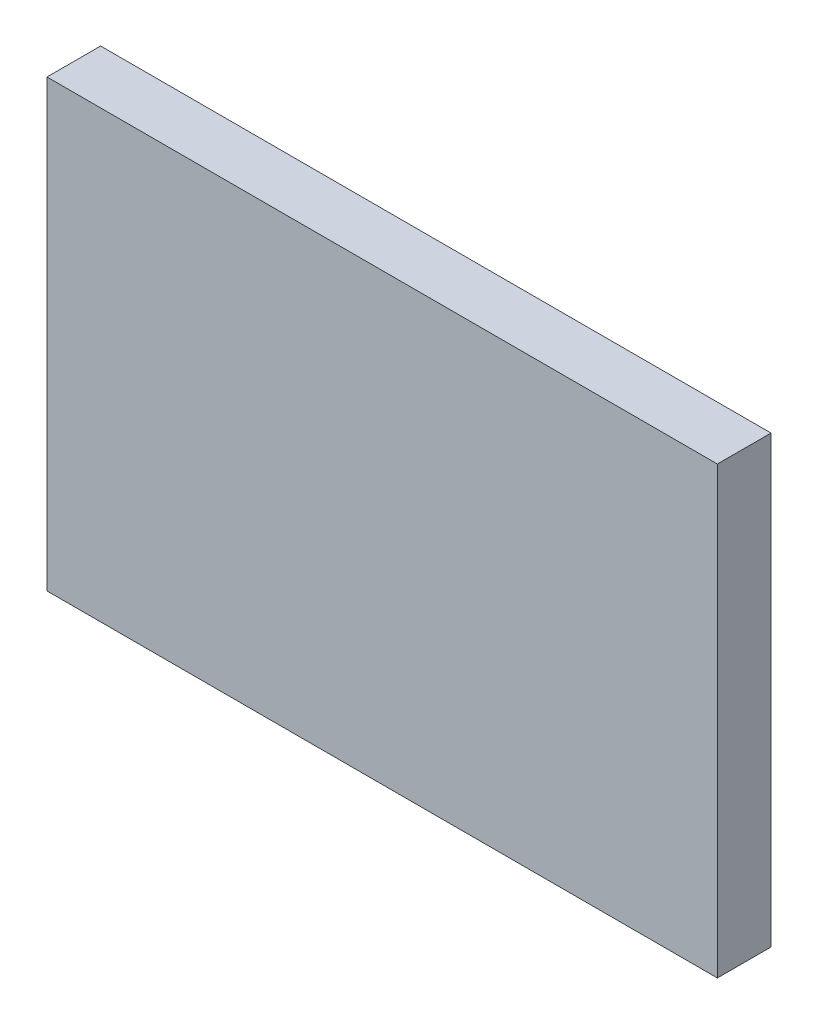
ISO-10303-21;
HEADER;
FILE_DESCRIPTION(('STEP AP214'),'2;1');
FILE_NAME('part.step','',(''),(''),'','','');
FILE_SCHEMA(('AUTOMOTIVE_DESIGN { 1 0 10303 214 1 1 1 1 }'));
ENDSEC;
DATA;
#1=APPLICATION_CONTEXT('core data for automotive mechanical design processes');
#2=APPLICATION_PROTOCOL_DEFINITION('international standard','automotive_design',2000,#1);
#3=PRODUCT_CONTEXT('',#1,'mechanical');
#4=PRODUCT('Part','Part','',(#3));
#5=PRODUCT_RELATED_PRODUCT_CATEGORY('part','',(#4));
#6=PRODUCT_DEFINITION_FORMATION('','',#4);
#7=PRODUCT_DEFINITION_CONTEXT('part definition',#1,'design');
#8=PRODUCT_DEFINITION('design','',#6,#7);
#9=PRODUCT_DEFINITION_SHAPE('','',#8);
#10=(LENGTH_UNIT() NAMED_UNIT(*) SI_UNIT(.MILLI.,.METRE.));
#11=(NAMED_UNIT(*) PLANE_ANGLE_UNIT() SI_UNIT($,.RADIAN.));
#12=(NAMED_UNIT(*) SI_UNIT($,.STERADIAN.) SOLID_ANGLE_UNIT());
#13=UNCERTAINTY_MEASURE_WITH_UNIT(LENGTH_MEASURE(1.E-05),#10,'distance_accuracy_value','');
#14=(GEOMETRIC_REPRESENTATION_CONTEXT(3) GLOBAL_UNCERTAINTY_ASSIGNED_CONTEXT((#13)) GLOBAL_UNIT_ASSIGNED_CONTEXT((#10,
#11,#12)) REPRESENTATION_CONTEXT('',''));
#15=CARTESIAN_POINT('',(0.,0.,0.));
#16=DIRECTION('',(0.,0.,1.));
#17=DIRECTION('',(1.,0.,0.));
#18=AXIS2_PLACEMENT_3D('',#15,#16,#17);
#19=CARTESIAN_POINT('',(0.,0.,0.05));
#20=DIRECTION('',(0.,0.,-1.));
#21=DIRECTION('',(0.,-1.,0.));
#22=AXIS2_PLACEMENT_3D('',#19,#20,#21);
#23=PLANE('',#22);
#24=DIRECTION('',(1.,0.,0.));
#25=VECTOR('',#24,1.);
#26=CARTESIAN_POINT('',(0.,0.,0.05));
#27=LINE('',#26,#25);
#28=CARTESIAN_POINT('',(0.,0.,0.05));
#29=VERTEX_POINT('',#28);
#30=CARTESIAN_POINT('',(0.625,0.,0.05));
#31=VERTEX_POINT('',#30);
#32=EDGE_CURVE('E82',#29,#31,#27,.T.);
#33=ORIENTED_EDGE('',*,*,#32,.T.);
#34=DIRECTION('',(0.,1.,0.));
#35=VECTOR('',#34,1.);
#36=CARTESIAN_POINT('',(0.625,0.,0.05));
#37=LINE('',#36,#35);
#38=CARTESIAN_POINT('',(0.625,0.415,0.05));
#39=VERTEX_POINT('',#38);
#40=EDGE_CURVE('E101',#31,#39,#37,.T.);
#41=ORIENTED_EDGE('',*,*,#40,.T.);
#42=DIRECTION('',(-1.,0.,0.));
#43=VECTOR('',#42,1.);
#44=CARTESIAN_POINT('',(0.625,0.415,0.05));
#45=LINE('',#44,#43);
#46=CARTESIAN_POINT('',(0.,0.415,0.05));
#47=VERTEX_POINT('',#46);
#48=EDGE_CURVE('E75',#39,#47,#45,.T.);
#49=ORIENTED_EDGE('',*,*,#48,.T.);
#50=DIRECTION('',(0.,-1.,0.));
#51=VECTOR('',#50,1.);
#52=CARTESIAN_POINT('',(0.,0.415,0.05));
#53=LINE('',#52,#51);
#54=EDGE_CURVE('E11',#47,#29,#53,.T.);
#55=ORIENTED_EDGE('',*,*,#54,.T.);
#56=EDGE_LOOP('',(#33,#41,#49,#55));
#57=FACE_BOUND('',#56,.T.);
#58=ADVANCED_FACE('F17',(#57),#23,.F.);
#59=CARTESIAN_POINT('',(0.,0.,0.));
#60=DIRECTION('',(0.,0.,-1.));
#61=DIRECTION('',(0.,-1.,0.));
#62=AXIS2_PLACEMENT_3D('',#59,#60,#61);
#63=PLANE('',#62);
#64=DIRECTION('',(0.,-1.,0.));
#65=VECTOR('',#64,1.);
#66=CARTESIAN_POINT('',(0.,0.415,0.));
#67=LINE('',#66,#65);
#68=CARTESIAN_POINT('',(0.,0.415,0.));
#69=VERTEX_POINT('',#68);
#70=CARTESIAN_POINT('',(0.,0.,0.));
#71=VERTEX_POINT('',#70);
#72=EDGE_CURVE('E20',#69,#71,#67,.T.);
#73=ORIENTED_EDGE('',*,*,#72,.F.);
#74=DIRECTION('',(-1.,0.,0.));
#75=VECTOR('',#74,1.);
#76=CARTESIAN_POINT('',(0.625,0.415,0.));
#77=LINE('',#76,#75);
#78=CARTESIAN_POINT('',(0.625,0.415,0.));
#79=VERTEX_POINT('',#78);
#80=EDGE_CURVE('E112',#79,#69,#77,.T.);
#81=ORIENTED_EDGE('',*,*,#80,.F.);
#82=DIRECTION('',(0.,1.,0.));
#83=VECTOR('',#82,1.);
#84=CARTESIAN_POINT('',(0.625,0.,0.));
#85=LINE('',#84,#83);
#86=CARTESIAN_POINT('',(0.625,0.,0.));
#87=VERTEX_POINT('',#86);
#88=EDGE_CURVE('E84',#87,#79,#85,.T.);
#89=ORIENTED_EDGE('',*,*,#88,.F.);
#90=DIRECTION('',(1.,0.,0.));
#91=VECTOR('',#90,1.);
#92=CARTESIAN_POINT('',(0.,0.,0.));
#93=LINE('',#92,#91);
#94=EDGE_CURVE('E80',#71,#87,#93,.T.);
#95=ORIENTED_EDGE('',*,*,#94,.F.);
#96=EDGE_LOOP('',(#73,#81,#89,#95));
#97=FACE_BOUND('',#96,.T.);
#98=ADVANCED_FACE('F86',(#97),#63,.T.);
#99=CARTESIAN_POINT('',(0.,0.415,0.));
#100=DIRECTION('',(1.,0.,0.));
#101=DIRECTION('',(0.,1.,0.));
#102=AXIS2_PLACEMENT_3D('',#99,#100,#101);
#103=PLANE('',#102);
#104=ORIENTED_EDGE('',*,*,#72,.T.);
#105=DIRECTION('',(0.,0.,1.));
#106=VECTOR('',#105,1.);
#107=CARTESIAN_POINT('',(0.,0.,0.));
#108=LINE('',#107,#106);
#109=EDGE_CURVE('E69',#71,#29,#108,.T.);
#110=ORIENTED_EDGE('',*,*,#109,.T.);
#111=ORIENTED_EDGE('',*,*,#54,.F.);
#112=DIRECTION('',(0.,0.,1.));
#113=VECTOR('',#112,1.);
#114=CARTESIAN_POINT('',(0.,0.415,0.));
#115=LINE('',#114,#113);
#116=EDGE_CURVE('E72',#69,#47,#115,.T.);
#117=ORIENTED_EDGE('',*,*,#116,.F.);
#118=EDGE_LOOP('',(#104,#110,#111,#117));
#119=FACE_BOUND('',#118,.T.);
#120=ADVANCED_FACE('F68',(#119),#103,.F.);
#121=CARTESIAN_POINT('',(0.625,0.415,0.));
#122=DIRECTION('',(0.,-1.,0.));
#123=DIRECTION('',(0.,0.,-1.));
#124=AXIS2_PLACEMENT_3D('',#121,#122,#123);
#125=PLANE('',#124);
#126=ORIENTED_EDGE('',*,*,#80,.T.);
#127=ORIENTED_EDGE('',*,*,#116,.T.);
#128=ORIENTED_EDGE('',*,*,#48,.F.);
#129=DIRECTION('',(0.,0.,1.));
#130=VECTOR('',#129,1.);
#131=CARTESIAN_POINT('',(0.625,0.415,0.));
#132=LINE('',#131,#130);
#133=EDGE_CURVE('E98',#79,#39,#132,.T.);
#134=ORIENTED_EDGE('',*,*,#133,.F.);
#135=EDGE_LOOP('',(#126,#127,#128,#134));
#136=FACE_BOUND('',#135,.T.);
#137=ADVANCED_FACE('F118',(#136),#125,.F.);
#138=CARTESIAN_POINT('',(0.625,0.,0.));
#139=DIRECTION('',(-1.,0.,0.));
#140=DIRECTION('',(0.,0.,1.));
#141=AXIS2_PLACEMENT_3D('',#138,#139,#140);
#142=PLANE('',#141);
#143=ORIENTED_EDGE('',*,*,#88,.T.);
#144=ORIENTED_EDGE('',*,*,#133,.T.);
#145=ORIENTED_EDGE('',*,*,#40,.F.);
#146=DIRECTION('',(0.,0.,1.));
#147=VECTOR('',#146,1.);
#148=CARTESIAN_POINT('',(0.625,0.,0.));
#149=LINE('',#148,#147);
#150=EDGE_CURVE('E90',#87,#31,#149,.T.);
#151=ORIENTED_EDGE('',*,*,#150,.F.);
#152=EDGE_LOOP('',(#143,#144,#145,#151));
#153=FACE_BOUND('',#152,.T.);
#154=ADVANCED_FACE('F121',(#153),#142,.F.);
#155=CARTESIAN_POINT('',(0.,0.,0.));
#156=DIRECTION('',(0.,1.,0.));
#157=DIRECTION('',(1.,0.,0.));
#158=AXIS2_PLACEMENT_3D('',#155,#156,#157);
#159=PLANE('',#158);
#160=ORIENTED_EDGE('',*,*,#94,.T.);
#161=ORIENTED_EDGE('',*,*,#150,.T.);
#162=ORIENTED_EDGE('',*,*,#32,.F.);
#163=ORIENTED_EDGE('',*,*,#109,.F.);
#164=EDGE_LOOP('',(#160,#161,#162,#163));
#165=FACE_BOUND('',#164,.T.);
#166=ADVANCED_FACE('F78',(#165),#159,.F.);
#167=CLOSED_SHELL('',(#58,#98,#120,#137,#154,#166));
#168=MANIFOLD_SOLID_BREP('B1',#167);
#169=ADVANCED_BREP_SHAPE_REPRESENTATION('',(#18,#168),#14);
#170=SHAPE_DEFINITION_REPRESENTATION(#9,#169);
ENDSEC;
END-ISO-10303-21;
